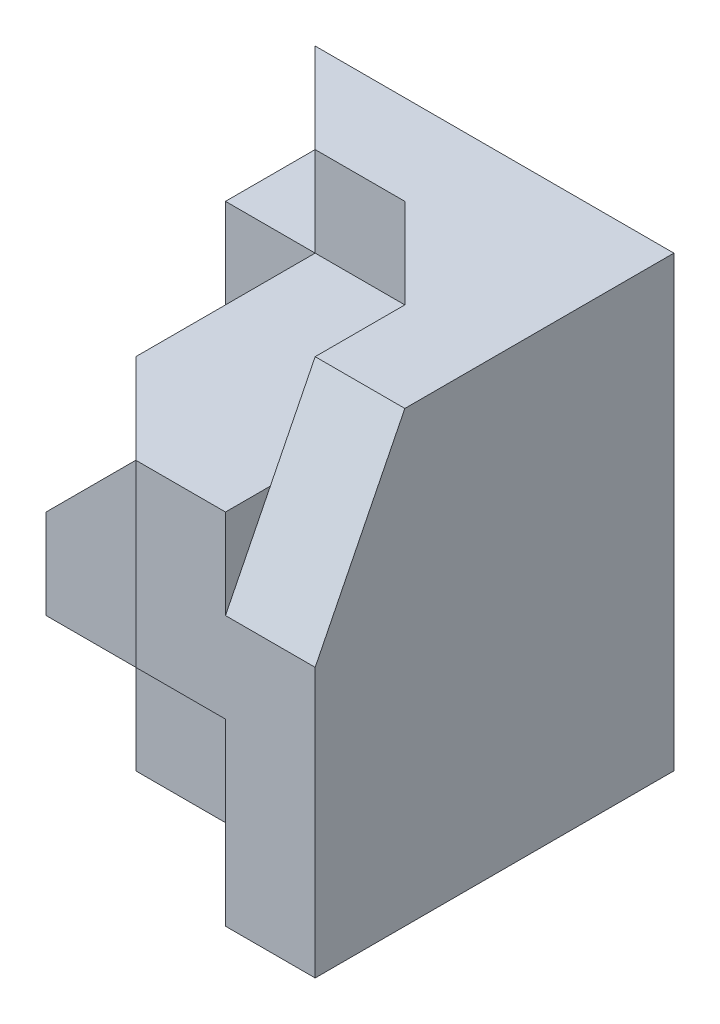
ISO-10303-21;
HEADER;
FILE_DESCRIPTION(('STEP AP214'),'2;1');
FILE_NAME('part.step','',(''),(''),'','','');
FILE_SCHEMA(('AUTOMOTIVE_DESIGN { 1 0 10303 214 1 1 1 1 }'));
ENDSEC;
DATA;
#1=APPLICATION_CONTEXT('core data for automotive mechanical design processes');
#2=APPLICATION_PROTOCOL_DEFINITION('international standard','automotive_design',2000,#1);
#3=PRODUCT_CONTEXT('',#1,'mechanical');
#4=PRODUCT('Part','Part','',(#3));
#5=PRODUCT_RELATED_PRODUCT_CATEGORY('part','',(#4));
#6=PRODUCT_DEFINITION_FORMATION('','',#4);
#7=PRODUCT_DEFINITION_CONTEXT('part definition',#1,'design');
#8=PRODUCT_DEFINITION('design','',#6,#7);
#9=PRODUCT_DEFINITION_SHAPE('','',#8);
#10=(LENGTH_UNIT() NAMED_UNIT(*) SI_UNIT(.MILLI.,.METRE.));
#11=(NAMED_UNIT(*) PLANE_ANGLE_UNIT() SI_UNIT($,.RADIAN.));
#12=(NAMED_UNIT(*) SI_UNIT($,.STERADIAN.) SOLID_ANGLE_UNIT());
#13=UNCERTAINTY_MEASURE_WITH_UNIT(LENGTH_MEASURE(1.E-05),#10,'distance_accuracy_value','');
#14=(GEOMETRIC_REPRESENTATION_CONTEXT(3) GLOBAL_UNCERTAINTY_ASSIGNED_CONTEXT((#13)) GLOBAL_UNIT_ASSIGNED_CONTEXT((#10,
#11,#12)) REPRESENTATION_CONTEXT('',''));
#15=CARTESIAN_POINT('',(0.,0.,0.));
#16=DIRECTION('',(0.,0.,1.));
#17=DIRECTION('',(1.,0.,0.));
#18=AXIS2_PLACEMENT_3D('',#15,#16,#17);
#19=CARTESIAN_POINT('',(-20.,50.,20.));
#20=DIRECTION('',(1.,0.,0.));
#21=DIRECTION('',(0.,0.,-1.));
#22=AXIS2_PLACEMENT_3D('',#19,#20,#21);
#23=PLANE('',#22);
#24=DIRECTION('',(0.,-1.,0.));
#25=VECTOR('',#24,1.);
#26=CARTESIAN_POINT('',(-20.,50.,-20.));
#27=LINE('',#26,#25);
#28=CARTESIAN_POINT('',(-20.,40.,-20.));
#29=VERTEX_POINT('',#28);
#30=CARTESIAN_POINT('',(-20.,10.,-20.));
#31=VERTEX_POINT('',#30);
#32=EDGE_CURVE('E192',#29,#31,#27,.T.);
#33=ORIENTED_EDGE('',*,*,#32,.T.);
#34=DIRECTION('',(0.,0.,1.));
#35=VECTOR('',#34,1.);
#36=CARTESIAN_POINT('',(-20.,10.,-20.));
#37=LINE('',#36,#35);
#38=CARTESIAN_POINT('',(-20.,10.,10.));
#39=VERTEX_POINT('',#38);
#40=EDGE_CURVE('E203',#31,#39,#37,.T.);
#41=ORIENTED_EDGE('',*,*,#40,.T.);
#42=DIRECTION('',(0.,-1.,0.));
#43=VECTOR('',#42,1.);
#44=CARTESIAN_POINT('',(-20.,0.,10.));
#45=LINE('',#44,#43);
#46=CARTESIAN_POINT('',(-20.,20.,10.));
#47=VERTEX_POINT('',#46);
#48=EDGE_CURVE('E223',#47,#39,#45,.T.);
#49=ORIENTED_EDGE('',*,*,#48,.F.);
#50=DIRECTION('',(0.,0.,1.));
#51=VECTOR('',#50,1.);
#52=CARTESIAN_POINT('',(-20.,20.,-9.99999999999999));
#53=LINE('',#52,#51);
#54=CARTESIAN_POINT('',(-20.,20.,-9.99999999999999));
#55=VERTEX_POINT('',#54);
#56=EDGE_CURVE('E243',#55,#47,#53,.T.);
#57=ORIENTED_EDGE('',*,*,#56,.F.);
#58=DIRECTION('',(0.,1.,0.));
#59=VECTOR('',#58,1.);
#60=CARTESIAN_POINT('',(-20.,30.,-10.));
#61=LINE('',#60,#59);
#62=CARTESIAN_POINT('',(-20.,40.,-10.));
#63=VERTEX_POINT('',#62);
#64=EDGE_CURVE('E256',#55,#63,#61,.T.);
#65=ORIENTED_EDGE('',*,*,#64,.T.);
#66=DIRECTION('',(0.,0.,1.));
#67=VECTOR('',#66,1.);
#68=CARTESIAN_POINT('',(-20.,40.,20.));
#69=LINE('',#68,#67);
#70=EDGE_CURVE('E207',#29,#63,#69,.T.);
#71=ORIENTED_EDGE('',*,*,#70,.F.);
#72=EDGE_LOOP('',(#33,#41,#49,#57,#65,#71));
#73=FACE_BOUND('',#72,.T.);
#74=ADVANCED_FACE('F33',(#73),#23,.F.);
#75=CARTESIAN_POINT('',(0.,40.,0.));
#76=DIRECTION('',(0.,-1.,0.));
#77=DIRECTION('',(0.,0.,-1.));
#78=AXIS2_PLACEMENT_3D('',#75,#76,#77);
#79=PLANE('',#78);
#80=ORIENTED_EDGE('',*,*,#70,.T.);
#81=DIRECTION('',(-1.,0.,0.));
#82=VECTOR('',#81,1.);
#83=CARTESIAN_POINT('',(-10.,40.,-10.));
#84=LINE('',#83,#82);
#85=CARTESIAN_POINT('',(-10.,40.,-10.));
#86=VERTEX_POINT('',#85);
#87=EDGE_CURVE('E250',#86,#63,#84,.T.);
#88=ORIENTED_EDGE('',*,*,#87,.F.);
#89=DIRECTION('',(-0.707106781186548,0.,-0.707106781186547));
#90=VECTOR('',#89,1.);
#91=CARTESIAN_POINT('',(-20.,40.,-20.));
#92=LINE('',#91,#90);
#93=EDGE_CURVE('E290',#86,#29,#92,.T.);
#94=ORIENTED_EDGE('',*,*,#93,.T.);
#95=EDGE_LOOP('',(#80,#88,#94));
#96=FACE_BOUND('',#95,.T.);
#97=ADVANCED_FACE('F341',(#96),#79,.F.);
#98=CARTESIAN_POINT('',(20.,50.,20.));
#99=DIRECTION('',(-1.,0.,0.));
#100=DIRECTION('',(0.,0.,1.));
#101=AXIS2_PLACEMENT_3D('',#98,#99,#100);
#102=PLANE('',#101);
#103=DIRECTION('',(0.,0.,-1.));
#104=VECTOR('',#103,1.);
#105=CARTESIAN_POINT('',(20.,50.,20.));
#106=LINE('',#105,#104);
#107=CARTESIAN_POINT('',(20.,50.,10.));
#108=VERTEX_POINT('',#107);
#109=CARTESIAN_POINT('',(20.,50.,-20.));
#110=VERTEX_POINT('',#109);
#111=EDGE_CURVE('E184',#108,#110,#106,.T.);
#112=ORIENTED_EDGE('',*,*,#111,.F.);
#113=DIRECTION('',(0.,0.894427190999916,-0.447213595499958));
#114=VECTOR('',#113,1.);
#115=CARTESIAN_POINT('',(20.,50.,10.));
#116=LINE('',#115,#114);
#117=CARTESIAN_POINT('',(20.,30.,20.));
#118=VERTEX_POINT('',#117);
#119=EDGE_CURVE('E258',#118,#108,#116,.T.);
#120=ORIENTED_EDGE('',*,*,#119,.F.);
#121=DIRECTION('',(0.,-1.,0.));
#122=VECTOR('',#121,1.);
#123=CARTESIAN_POINT('',(20.,50.,20.));
#124=LINE('',#123,#122);
#125=CARTESIAN_POINT('',(20.,0.,20.));
#126=VERTEX_POINT('',#125);
#127=EDGE_CURVE('E190',#118,#126,#124,.T.);
#128=ORIENTED_EDGE('',*,*,#127,.T.);
#129=DIRECTION('',(0.,0.,-1.));
#130=VECTOR('',#129,1.);
#131=CARTESIAN_POINT('',(20.,0.,20.));
#132=LINE('',#131,#130);
#133=CARTESIAN_POINT('',(20.,0.,-20.));
#134=VERTEX_POINT('',#133);
#135=EDGE_CURVE('E182',#126,#134,#132,.T.);
#136=ORIENTED_EDGE('',*,*,#135,.T.);
#137=DIRECTION('',(0.,-1.,0.));
#138=VECTOR('',#137,1.);
#139=CARTESIAN_POINT('',(20.,50.,-20.));
#140=LINE('',#139,#138);
#141=EDGE_CURVE('E11',#110,#134,#140,.T.);
#142=ORIENTED_EDGE('',*,*,#141,.F.);
#143=EDGE_LOOP('',(#112,#120,#128,#136,#142));
#144=FACE_BOUND('',#143,.T.);
#145=ADVANCED_FACE('F35',(#144),#102,.F.);
#146=CARTESIAN_POINT('',(-20.,50.,-20.));
#147=DIRECTION('',(0.,0.,1.));
#148=DIRECTION('',(1.,0.,0.));
#149=AXIS2_PLACEMENT_3D('',#146,#147,#148);
#150=PLANE('',#149);
#151=DIRECTION('',(0.,1.,0.));
#152=VECTOR('',#151,1.);
#153=CARTESIAN_POINT('',(-10.,0.,-20.));
#154=LINE('',#153,#152);
#155=CARTESIAN_POINT('',(-10.,0.,-20.));
#156=VERTEX_POINT('',#155);
#157=CARTESIAN_POINT('',(-10.,10.,-20.));
#158=VERTEX_POINT('',#157);
#159=EDGE_CURVE('E159',#156,#158,#154,.T.);
#160=ORIENTED_EDGE('',*,*,#159,.T.);
#161=DIRECTION('',(-1.,0.,0.));
#162=VECTOR('',#161,1.);
#163=CARTESIAN_POINT('',(-20.,10.,-20.));
#164=LINE('',#163,#162);
#165=EDGE_CURVE('E166',#158,#31,#164,.T.);
#166=ORIENTED_EDGE('',*,*,#165,.T.);
#167=ORIENTED_EDGE('',*,*,#32,.F.);
#168=CARTESIAN_POINT('',(-20.,50.,-20.));
#169=VERTEX_POINT('',#168);
#170=EDGE_CURVE('E41',#169,#29,#27,.T.);
#171=ORIENTED_EDGE('',*,*,#170,.F.);
#172=DIRECTION('',(-1.,0.,0.));
#173=VECTOR('',#172,1.);
#174=CARTESIAN_POINT('',(-20.,50.,-20.));
#175=LINE('',#174,#173);
#176=EDGE_CURVE('E193',#110,#169,#175,.T.);
#177=ORIENTED_EDGE('',*,*,#176,.F.);
#178=ORIENTED_EDGE('',*,*,#141,.T.);
#179=DIRECTION('',(-1.,0.,0.));
#180=VECTOR('',#179,1.);
#181=CARTESIAN_POINT('',(-20.,0.,-20.));
#182=LINE('',#181,#180);
#183=EDGE_CURVE('E173',#134,#156,#182,.T.);
#184=ORIENTED_EDGE('',*,*,#183,.T.);
#185=EDGE_LOOP('',(#160,#166,#167,#171,#177,#178,#184));
#186=FACE_BOUND('',#185,.T.);
#187=ADVANCED_FACE('F177',(#186),#150,.F.);
#188=CARTESIAN_POINT('',(-20.,50.,20.));
#189=DIRECTION('',(0.,0.,-1.));
#190=DIRECTION('',(-1.,0.,0.));
#191=AXIS2_PLACEMENT_3D('',#188,#189,#190);
#192=PLANE('',#191);
#193=DIRECTION('',(-1.,0.,0.));
#194=VECTOR('',#193,1.);
#195=CARTESIAN_POINT('',(9.99999999999999,20.,20.));
#196=LINE('',#195,#194);
#197=CARTESIAN_POINT('',(9.99999999999999,20.,20.));
#198=VERTEX_POINT('',#197);
#199=CARTESIAN_POINT('',(0.,20.,20.));
#200=VERTEX_POINT('',#199);
#201=EDGE_CURVE('E221',#198,#200,#196,.T.);
#202=ORIENTED_EDGE('',*,*,#201,.F.);
#203=DIRECTION('',(0.,1.,0.));
#204=VECTOR('',#203,1.);
#205=CARTESIAN_POINT('',(9.99999999999999,0.,20.));
#206=LINE('',#205,#204);
#207=CARTESIAN_POINT('',(9.99999999999999,0.,20.));
#208=VERTEX_POINT('',#207);
#209=EDGE_CURVE('E215',#208,#198,#206,.T.);
#210=ORIENTED_EDGE('',*,*,#209,.F.);
#211=DIRECTION('',(1.,0.,0.));
#212=VECTOR('',#211,1.);
#213=CARTESIAN_POINT('',(-20.,0.,20.));
#214=LINE('',#213,#212);
#215=EDGE_CURVE('E181',#208,#126,#214,.T.);
#216=ORIENTED_EDGE('',*,*,#215,.T.);
#217=ORIENTED_EDGE('',*,*,#127,.F.);
#218=DIRECTION('',(1.,0.,0.));
#219=VECTOR('',#218,1.);
#220=CARTESIAN_POINT('',(10.,30.,20.));
#221=LINE('',#220,#219);
#222=CARTESIAN_POINT('',(10.,30.,20.));
#223=VERTEX_POINT('',#222);
#224=EDGE_CURVE('E269',#223,#118,#221,.T.);
#225=ORIENTED_EDGE('',*,*,#224,.F.);
#226=DIRECTION('',(0.,-1.,0.));
#227=VECTOR('',#226,1.);
#228=CARTESIAN_POINT('',(10.,30.,20.));
#229=LINE('',#228,#227);
#230=CARTESIAN_POINT('',(10.,40.,20.));
#231=VERTEX_POINT('',#230);
#232=EDGE_CURVE('E264',#231,#223,#229,.T.);
#233=ORIENTED_EDGE('',*,*,#232,.F.);
#234=DIRECTION('',(1.,0.,0.));
#235=VECTOR('',#234,1.);
#236=CARTESIAN_POINT('',(10.,40.,20.));
#237=LINE('',#236,#235);
#238=CARTESIAN_POINT('',(0.,40.,20.));
#239=VERTEX_POINT('',#238);
#240=EDGE_CURVE('E277',#239,#231,#237,.T.);
#241=ORIENTED_EDGE('',*,*,#240,.F.);
#242=DIRECTION('',(0.,1.,0.));
#243=VECTOR('',#242,1.);
#244=CARTESIAN_POINT('',(0.,30.,20.));
#245=LINE('',#244,#243);
#246=EDGE_CURVE('E56',#200,#239,#245,.T.);
#247=ORIENTED_EDGE('',*,*,#246,.F.);
#248=EDGE_LOOP('',(#202,#210,#216,#217,#225,#233,#241,#247));
#249=FACE_BOUND('',#248,.T.);
#250=ADVANCED_FACE('F320',(#249),#192,.F.);
#251=CARTESIAN_POINT('',(0.,50.,0.));
#252=DIRECTION('',(0.,-1.,0.));
#253=DIRECTION('',(0.,0.,-1.));
#254=AXIS2_PLACEMENT_3D('',#251,#252,#253);
#255=PLANE('',#254);
#256=DIRECTION('',(0.,0.,-1.));
#257=VECTOR('',#256,1.);
#258=CARTESIAN_POINT('',(10.,50.,0.));
#259=LINE('',#258,#257);
#260=CARTESIAN_POINT('',(10.,50.,10.));
#261=VERTEX_POINT('',#260);
#262=CARTESIAN_POINT('',(10.,50.,0.));
#263=VERTEX_POINT('',#262);
#264=EDGE_CURVE('E274',#261,#263,#259,.T.);
#265=ORIENTED_EDGE('',*,*,#264,.F.);
#266=DIRECTION('',(1.,0.,0.));
#267=VECTOR('',#266,1.);
#268=CARTESIAN_POINT('',(10.,50.,10.));
#269=LINE('',#268,#267);
#270=EDGE_CURVE('E271',#261,#108,#269,.T.);
#271=ORIENTED_EDGE('',*,*,#270,.T.);
#272=ORIENTED_EDGE('',*,*,#111,.T.);
#273=ORIENTED_EDGE('',*,*,#176,.T.);
#274=DIRECTION('',(-0.707106781186548,0.,-0.707106781186547));
#275=VECTOR('',#274,1.);
#276=CARTESIAN_POINT('',(-20.,50.,-20.));
#277=LINE('',#276,#275);
#278=CARTESIAN_POINT('',(-10.,50.,-10.));
#279=VERTEX_POINT('',#278);
#280=EDGE_CURVE('E278',#279,#169,#277,.T.);
#281=ORIENTED_EDGE('',*,*,#280,.F.);
#282=DIRECTION('',(-1.,0.,0.));
#283=VECTOR('',#282,1.);
#284=CARTESIAN_POINT('',(-10.,50.,-10.));
#285=LINE('',#284,#283);
#286=CARTESIAN_POINT('',(0.,50.,-10.));
#287=VERTEX_POINT('',#286);
#288=EDGE_CURVE('E297',#287,#279,#285,.T.);
#289=ORIENTED_EDGE('',*,*,#288,.F.);
#290=DIRECTION('',(-0.707106781186548,0.,-0.707106781186548));
#291=VECTOR('',#290,1.);
#292=CARTESIAN_POINT('',(0.,50.,-10.));
#293=LINE('',#292,#291);
#294=EDGE_CURVE('E294',#263,#287,#293,.T.);
#295=ORIENTED_EDGE('',*,*,#294,.F.);
#296=EDGE_LOOP('',(#265,#271,#272,#273,#281,#289,#295));
#297=FACE_BOUND('',#296,.T.);
#298=ADVANCED_FACE('F310',(#297),#255,.F.);
#299=CARTESIAN_POINT('',(0.,0.,0.));
#300=DIRECTION('',(0.,-1.,0.));
#301=DIRECTION('',(0.,0.,-1.));
#302=AXIS2_PLACEMENT_3D('',#299,#300,#301);
#303=PLANE('',#302);
#304=DIRECTION('',(0.,0.,1.));
#305=VECTOR('',#304,1.);
#306=CARTESIAN_POINT('',(-10.,0.,-20.));
#307=LINE('',#306,#305);
#308=CARTESIAN_POINT('',(-10.,0.,10.));
#309=VERTEX_POINT('',#308);
#310=EDGE_CURVE('E48',#156,#309,#307,.T.);
#311=ORIENTED_EDGE('',*,*,#310,.F.);
#312=ORIENTED_EDGE('',*,*,#183,.F.);
#313=ORIENTED_EDGE('',*,*,#135,.F.);
#314=ORIENTED_EDGE('',*,*,#215,.F.);
#315=DIRECTION('',(0.,0.,1.));
#316=VECTOR('',#315,1.);
#317=CARTESIAN_POINT('',(9.99999999999999,0.,10.));
#318=LINE('',#317,#316);
#319=CARTESIAN_POINT('',(9.99999999999999,0.,10.));
#320=VERTEX_POINT('',#319);
#321=EDGE_CURVE('E230',#320,#208,#318,.T.);
#322=ORIENTED_EDGE('',*,*,#321,.F.);
#323=DIRECTION('',(1.,0.,0.));
#324=VECTOR('',#323,1.);
#325=CARTESIAN_POINT('',(9.99999999999999,0.,10.));
#326=LINE('',#325,#324);
#327=EDGE_CURVE('E175',#309,#320,#326,.T.);
#328=ORIENTED_EDGE('',*,*,#327,.F.);
#329=EDGE_LOOP('',(#311,#312,#313,#314,#322,#328));
#330=FACE_BOUND('',#329,.T.);
#331=ADVANCED_FACE('F171',(#330),#303,.T.);
#332=CARTESIAN_POINT('',(-20.,40.,-20.));
#333=DIRECTION('',(0.707106781186547,0.,-0.707106781186548));
#334=DIRECTION('',(-0.707106781186548,0.,-0.707106781186547));
#335=AXIS2_PLACEMENT_3D('',#332,#333,#334);
#336=PLANE('',#335);
#337=ORIENTED_EDGE('',*,*,#280,.T.);
#338=ORIENTED_EDGE('',*,*,#170,.T.);
#339=ORIENTED_EDGE('',*,*,#93,.F.);
#340=DIRECTION('',(0.,1.,0.));
#341=VECTOR('',#340,1.);
#342=CARTESIAN_POINT('',(-10.,40.,-10.));
#343=LINE('',#342,#341);
#344=EDGE_CURVE('E186',#86,#279,#343,.T.);
#345=ORIENTED_EDGE('',*,*,#344,.T.);
#346=EDGE_LOOP('',(#337,#338,#339,#345));
#347=FACE_BOUND('',#346,.T.);
#348=ADVANCED_FACE('F376',(#347),#336,.F.);
#349=CARTESIAN_POINT('',(-10.,40.,-10.));
#350=DIRECTION('',(0.,0.,-1.));
#351=DIRECTION('',(-1.,0.,0.));
#352=AXIS2_PLACEMENT_3D('',#349,#350,#351);
#353=PLANE('',#352);
#354=ORIENTED_EDGE('',*,*,#288,.T.);
#355=ORIENTED_EDGE('',*,*,#344,.F.);
#356=DIRECTION('',(-1.,0.,0.));
#357=VECTOR('',#356,1.);
#358=CARTESIAN_POINT('',(-10.,40.,-10.));
#359=LINE('',#358,#357);
#360=CARTESIAN_POINT('',(0.,40.,-10.));
#361=VERTEX_POINT('',#360);
#362=EDGE_CURVE('E287',#361,#86,#359,.T.);
#363=ORIENTED_EDGE('',*,*,#362,.F.);
#364=DIRECTION('',(0.,1.,0.));
#365=VECTOR('',#364,1.);
#366=CARTESIAN_POINT('',(0.,40.,-10.));
#367=LINE('',#366,#365);
#368=EDGE_CURVE('E302',#361,#287,#367,.T.);
#369=ORIENTED_EDGE('',*,*,#368,.T.);
#370=EDGE_LOOP('',(#354,#355,#363,#369));
#371=FACE_BOUND('',#370,.T.);
#372=ADVANCED_FACE('F381',(#371),#353,.F.);
#373=CARTESIAN_POINT('',(0.,40.,-10.));
#374=DIRECTION('',(0.707106781186548,0.,-0.707106781186548));
#375=DIRECTION('',(-0.707106781186548,0.,-0.707106781186548));
#376=AXIS2_PLACEMENT_3D('',#373,#374,#375);
#377=PLANE('',#376);
#378=ORIENTED_EDGE('',*,*,#294,.T.);
#379=ORIENTED_EDGE('',*,*,#368,.F.);
#380=DIRECTION('',(-0.707106781186548,0.,-0.707106781186548));
#381=VECTOR('',#380,1.);
#382=CARTESIAN_POINT('',(0.,40.,-10.));
#383=LINE('',#382,#381);
#384=CARTESIAN_POINT('',(10.,40.,0.));
#385=VERTEX_POINT('',#384);
#386=EDGE_CURVE('E284',#385,#361,#383,.T.);
#387=ORIENTED_EDGE('',*,*,#386,.F.);
#388=DIRECTION('',(0.,1.,0.));
#389=VECTOR('',#388,1.);
#390=CARTESIAN_POINT('',(10.,40.,0.));
#391=LINE('',#390,#389);
#392=EDGE_CURVE('E292',#385,#263,#391,.T.);
#393=ORIENTED_EDGE('',*,*,#392,.T.);
#394=EDGE_LOOP('',(#378,#379,#387,#393));
#395=FACE_BOUND('',#394,.T.);
#396=ADVANCED_FACE('F392',(#395),#377,.F.);
#397=CARTESIAN_POINT('',(10.,40.,0.));
#398=DIRECTION('',(1.,0.,0.));
#399=DIRECTION('',(0.,0.,-1.));
#400=AXIS2_PLACEMENT_3D('',#397,#398,#399);
#401=PLANE('',#400);
#402=DIRECTION('',(0.,0.,-1.));
#403=VECTOR('',#402,1.);
#404=CARTESIAN_POINT('',(10.,40.,0.));
#405=LINE('',#404,#403);
#406=CARTESIAN_POINT('',(10.,40.,15.));
#407=VERTEX_POINT('',#406);
#408=EDGE_CURVE('E280',#407,#385,#405,.T.);
#409=ORIENTED_EDGE('',*,*,#408,.F.);
#410=DIRECTION('',(0.,0.894427190999916,-0.447213595499958));
#411=VECTOR('',#410,1.);
#412=CARTESIAN_POINT('',(10.,50.,10.));
#413=LINE('',#412,#411);
#414=EDGE_CURVE('E266',#407,#261,#413,.T.);
#415=ORIENTED_EDGE('',*,*,#414,.T.);
#416=ORIENTED_EDGE('',*,*,#264,.T.);
#417=ORIENTED_EDGE('',*,*,#392,.F.);
#418=EDGE_LOOP('',(#409,#415,#416,#417));
#419=FACE_BOUND('',#418,.T.);
#420=ADVANCED_FACE('F405',(#419),#401,.F.);
#421=ORIENTED_EDGE('',*,*,#362,.T.);
#422=DIRECTION('',(0.,0.,-1.));
#423=VECTOR('',#422,1.);
#424=CARTESIAN_POINT('',(-10.,40.,-10.));
#425=LINE('',#424,#423);
#426=CARTESIAN_POINT('',(-10.,40.,10.));
#427=VERTEX_POINT('',#426);
#428=EDGE_CURVE('E252',#427,#86,#425,.T.);
#429=ORIENTED_EDGE('',*,*,#428,.F.);
#430=DIRECTION('',(-0.707106781186548,0.,-0.707106781186547));
#431=VECTOR('',#430,1.);
#432=CARTESIAN_POINT('',(0.,40.,20.));
#433=LINE('',#432,#431);
#434=EDGE_CURVE('E246',#239,#427,#433,.T.);
#435=ORIENTED_EDGE('',*,*,#434,.F.);
#436=ORIENTED_EDGE('',*,*,#240,.T.);
#437=EDGE_CURVE('E281',#231,#407,#405,.T.);
#438=ORIENTED_EDGE('',*,*,#437,.T.);
#439=ORIENTED_EDGE('',*,*,#408,.T.);
#440=ORIENTED_EDGE('',*,*,#386,.T.);
#441=EDGE_LOOP('',(#421,#429,#435,#436,#438,#439,#440));
#442=FACE_BOUND('',#441,.T.);
#443=ADVANCED_FACE('F348',(#442),#79,.F.);
#444=CARTESIAN_POINT('',(10.,0.,0.));
#445=DIRECTION('',(-1.,0.,0.));
#446=DIRECTION('',(0.,0.,1.));
#447=AXIS2_PLACEMENT_3D('',#444,#445,#446);
#448=PLANE('',#447);
#449=ORIENTED_EDGE('',*,*,#232,.T.);
#450=EDGE_CURVE('E267',#223,#407,#413,.T.);
#451=ORIENTED_EDGE('',*,*,#450,.T.);
#452=ORIENTED_EDGE('',*,*,#437,.F.);
#453=EDGE_LOOP('',(#449,#451,#452));
#454=FACE_BOUND('',#453,.T.);
#455=ADVANCED_FACE('F404',(#454),#448,.F.);
#456=CARTESIAN_POINT('',(10.,50.,10.));
#457=DIRECTION('',(0.,-0.447213595499958,-0.894427190999916));
#458=DIRECTION('',(0.,0.894427190999916,-0.447213595499958));
#459=AXIS2_PLACEMENT_3D('',#456,#457,#458);
#460=PLANE('',#459);
#461=ORIENTED_EDGE('',*,*,#119,.T.);
#462=ORIENTED_EDGE('',*,*,#270,.F.);
#463=ORIENTED_EDGE('',*,*,#414,.F.);
#464=ORIENTED_EDGE('',*,*,#450,.F.);
#465=ORIENTED_EDGE('',*,*,#224,.T.);
#466=EDGE_LOOP('',(#461,#462,#463,#464,#465));
#467=FACE_BOUND('',#466,.T.);
#468=ADVANCED_FACE('F372',(#467),#460,.F.);
#469=CARTESIAN_POINT('',(-10.,30.,-10.));
#470=DIRECTION('',(0.,0.,-1.));
#471=DIRECTION('',(-1.,0.,0.));
#472=AXIS2_PLACEMENT_3D('',#469,#470,#471);
#473=PLANE('',#472);
#474=ORIENTED_EDGE('',*,*,#87,.T.);
#475=ORIENTED_EDGE('',*,*,#64,.F.);
#476=DIRECTION('',(0.707106781186547,0.707106781186548,0.));
#477=VECTOR('',#476,1.);
#478=CARTESIAN_POINT('',(-10.,30.,-9.99999999999999));
#479=LINE('',#478,#477);
#480=CARTESIAN_POINT('',(-10.,30.,-10.));
#481=VERTEX_POINT('',#480);
#482=EDGE_CURVE('E241',#55,#481,#479,.T.);
#483=ORIENTED_EDGE('',*,*,#482,.T.);
#484=DIRECTION('',(0.,1.,0.));
#485=VECTOR('',#484,1.);
#486=CARTESIAN_POINT('',(-10.,30.,-10.));
#487=LINE('',#486,#485);
#488=EDGE_CURVE('E259',#481,#86,#487,.T.);
#489=ORIENTED_EDGE('',*,*,#488,.T.);
#490=EDGE_LOOP('',(#474,#475,#483,#489));
#491=FACE_BOUND('',#490,.T.);
#492=ADVANCED_FACE('F414',(#491),#473,.F.);
#493=CARTESIAN_POINT('',(-10.,30.,-10.));
#494=DIRECTION('',(1.,0.,0.));
#495=DIRECTION('',(0.,0.,-1.));
#496=AXIS2_PLACEMENT_3D('',#493,#494,#495);
#497=PLANE('',#496);
#498=ORIENTED_EDGE('',*,*,#428,.T.);
#499=ORIENTED_EDGE('',*,*,#488,.F.);
#500=DIRECTION('',(0.,0.,-1.));
#501=VECTOR('',#500,1.);
#502=CARTESIAN_POINT('',(-10.,30.,-10.));
#503=LINE('',#502,#501);
#504=CARTESIAN_POINT('',(-10.,30.,10.));
#505=VERTEX_POINT('',#504);
#506=EDGE_CURVE('E247',#505,#481,#503,.T.);
#507=ORIENTED_EDGE('',*,*,#506,.F.);
#508=DIRECTION('',(0.,1.,0.));
#509=VECTOR('',#508,1.);
#510=CARTESIAN_POINT('',(-10.,30.,10.));
#511=LINE('',#510,#509);
#512=EDGE_CURVE('E261',#505,#427,#511,.T.);
#513=ORIENTED_EDGE('',*,*,#512,.T.);
#514=EDGE_LOOP('',(#498,#499,#507,#513));
#515=FACE_BOUND('',#514,.T.);
#516=ADVANCED_FACE('F419',(#515),#497,.F.);
#517=CARTESIAN_POINT('',(0.,30.,20.));
#518=DIRECTION('',(0.707106781186547,0.,-0.707106781186548));
#519=DIRECTION('',(-0.707106781186548,0.,-0.707106781186547));
#520=AXIS2_PLACEMENT_3D('',#517,#518,#519);
#521=PLANE('',#520);
#522=ORIENTED_EDGE('',*,*,#434,.T.);
#523=ORIENTED_EDGE('',*,*,#512,.F.);
#524=DIRECTION('',(0.,1.,0.));
#525=VECTOR('',#524,1.);
#526=CARTESIAN_POINT('',(-10.,20.,10.));
#527=LINE('',#526,#525);
#528=CARTESIAN_POINT('',(-10.,20.,10.));
#529=VERTEX_POINT('',#528);
#530=EDGE_CURVE('E239',#529,#505,#527,.T.);
#531=ORIENTED_EDGE('',*,*,#530,.F.);
#532=DIRECTION('',(-0.707106781186548,0.,-0.707106781186548));
#533=VECTOR('',#532,1.);
#534=CARTESIAN_POINT('',(0.,20.,20.));
#535=LINE('',#534,#533);
#536=EDGE_CURVE('E236',#200,#529,#535,.T.);
#537=ORIENTED_EDGE('',*,*,#536,.F.);
#538=ORIENTED_EDGE('',*,*,#246,.T.);
#539=EDGE_LOOP('',(#522,#523,#531,#537,#538));
#540=FACE_BOUND('',#539,.T.);
#541=ADVANCED_FACE('F431',(#540),#521,.F.);
#542=CARTESIAN_POINT('',(-10.,30.,-9.99999999999999));
#543=DIRECTION('',(0.707106781186548,-0.707106781186547,0.));
#544=DIRECTION('',(0.707106781186547,0.707106781186548,0.));
#545=AXIS2_PLACEMENT_3D('',#542,#543,#544);
#546=PLANE('',#545);
#547=ORIENTED_EDGE('',*,*,#56,.T.);
#548=DIRECTION('',(0.707106781186547,0.707106781186548,0.));
#549=VECTOR('',#548,1.);
#550=CARTESIAN_POINT('',(-10.,30.,10.));
#551=LINE('',#550,#549);
#552=EDGE_CURVE('E232',#47,#505,#551,.T.);
#553=ORIENTED_EDGE('',*,*,#552,.T.);
#554=ORIENTED_EDGE('',*,*,#506,.T.);
#555=ORIENTED_EDGE('',*,*,#482,.F.);
#556=EDGE_LOOP('',(#547,#553,#554,#555));
#557=FACE_BOUND('',#556,.T.);
#558=ADVANCED_FACE('F450',(#557),#546,.F.);
#559=CARTESIAN_POINT('',(-20.,20.,10.));
#560=DIRECTION('',(0.,0.,-1.));
#561=DIRECTION('',(-1.,0.,0.));
#562=AXIS2_PLACEMENT_3D('',#559,#560,#561);
#563=PLANE('',#562);
#564=ORIENTED_EDGE('',*,*,#48,.T.);
#565=DIRECTION('',(-1.,0.,0.));
#566=VECTOR('',#565,1.);
#567=CARTESIAN_POINT('',(-20.,10.,10.));
#568=LINE('',#567,#566);
#569=CARTESIAN_POINT('',(-10.,10.,10.));
#570=VERTEX_POINT('',#569);
#571=EDGE_CURVE('E167',#570,#39,#568,.T.);
#572=ORIENTED_EDGE('',*,*,#571,.F.);
#573=DIRECTION('',(0.,1.,0.));
#574=VECTOR('',#573,1.);
#575=CARTESIAN_POINT('',(-10.,0.,10.));
#576=LINE('',#575,#574);
#577=EDGE_CURVE('E211',#309,#570,#576,.T.);
#578=ORIENTED_EDGE('',*,*,#577,.F.);
#579=ORIENTED_EDGE('',*,*,#327,.T.);
#580=DIRECTION('',(0.,1.,0.));
#581=VECTOR('',#580,1.);
#582=CARTESIAN_POINT('',(9.99999999999999,0.,10.));
#583=LINE('',#582,#581);
#584=CARTESIAN_POINT('',(9.99999999999999,20.,10.));
#585=VERTEX_POINT('',#584);
#586=EDGE_CURVE('E217',#320,#585,#583,.T.);
#587=ORIENTED_EDGE('',*,*,#586,.T.);
#588=DIRECTION('',(-1.,0.,0.));
#589=VECTOR('',#588,1.);
#590=CARTESIAN_POINT('',(9.99999999999999,20.,10.));
#591=LINE('',#590,#589);
#592=EDGE_CURVE('E220',#585,#529,#591,.T.);
#593=ORIENTED_EDGE('',*,*,#592,.T.);
#594=ORIENTED_EDGE('',*,*,#530,.T.);
#595=ORIENTED_EDGE('',*,*,#552,.F.);
#596=EDGE_LOOP('',(#564,#572,#578,#579,#587,#593,#594,#595));
#597=FACE_BOUND('',#596,.T.);
#598=ADVANCED_FACE('F327',(#597),#563,.F.);
#599=CARTESIAN_POINT('',(9.99999999999999,20.,10.));
#600=DIRECTION('',(0.,1.,0.));
#601=DIRECTION('',(0.,0.,1.));
#602=AXIS2_PLACEMENT_3D('',#599,#600,#601);
#603=PLANE('',#602);
#604=ORIENTED_EDGE('',*,*,#592,.F.);
#605=DIRECTION('',(0.,0.,1.));
#606=VECTOR('',#605,1.);
#607=CARTESIAN_POINT('',(9.99999999999999,20.,10.));
#608=LINE('',#607,#606);
#609=EDGE_CURVE('E226',#585,#198,#608,.T.);
#610=ORIENTED_EDGE('',*,*,#609,.T.);
#611=ORIENTED_EDGE('',*,*,#201,.T.);
#612=ORIENTED_EDGE('',*,*,#536,.T.);
#613=EDGE_LOOP('',(#604,#610,#611,#612));
#614=FACE_BOUND('',#613,.T.);
#615=ADVANCED_FACE('F338',(#614),#603,.F.);
#616=CARTESIAN_POINT('',(9.99999999999999,0.,10.));
#617=DIRECTION('',(1.,0.,0.));
#618=DIRECTION('',(0.,0.,-1.));
#619=AXIS2_PLACEMENT_3D('',#616,#617,#618);
#620=PLANE('',#619);
#621=ORIENTED_EDGE('',*,*,#209,.T.);
#622=ORIENTED_EDGE('',*,*,#609,.F.);
#623=ORIENTED_EDGE('',*,*,#586,.F.);
#624=ORIENTED_EDGE('',*,*,#321,.T.);
#625=EDGE_LOOP('',(#621,#622,#623,#624));
#626=FACE_BOUND('',#625,.T.);
#627=ADVANCED_FACE('F323',(#626),#620,.F.);
#628=CARTESIAN_POINT('',(-20.,10.,-20.));
#629=DIRECTION('',(0.,1.,0.));
#630=DIRECTION('',(0.,0.,1.));
#631=AXIS2_PLACEMENT_3D('',#628,#629,#630);
#632=PLANE('',#631);
#633=ORIENTED_EDGE('',*,*,#571,.T.);
#634=ORIENTED_EDGE('',*,*,#40,.F.);
#635=ORIENTED_EDGE('',*,*,#165,.F.);
#636=DIRECTION('',(0.,0.,1.));
#637=VECTOR('',#636,1.);
#638=CARTESIAN_POINT('',(-10.,10.,-20.));
#639=LINE('',#638,#637);
#640=EDGE_CURVE('E161',#158,#570,#639,.T.);
#641=ORIENTED_EDGE('',*,*,#640,.T.);
#642=EDGE_LOOP('',(#633,#634,#635,#641));
#643=FACE_BOUND('',#642,.T.);
#644=ADVANCED_FACE('F330',(#643),#632,.F.);
#645=CARTESIAN_POINT('',(-10.,0.,-20.));
#646=DIRECTION('',(1.,0.,0.));
#647=DIRECTION('',(0.,0.,-1.));
#648=AXIS2_PLACEMENT_3D('',#645,#646,#647);
#649=PLANE('',#648);
#650=ORIENTED_EDGE('',*,*,#577,.T.);
#651=ORIENTED_EDGE('',*,*,#640,.F.);
#652=ORIENTED_EDGE('',*,*,#159,.F.);
#653=ORIENTED_EDGE('',*,*,#310,.T.);
#654=EDGE_LOOP('',(#650,#651,#652,#653));
#655=FACE_BOUND('',#654,.T.);
#656=ADVANCED_FACE('F160',(#655),#649,.F.);
#657=CLOSED_SHELL('',(#74,#97,#145,#187,#250,#298,#331,#348,#372,#396,#420,#443,#455,#468,#492,
#516,#541,#558,#598,#615,#627,#644,#656));
#658=MANIFOLD_SOLID_BREP('B2',#657);
#659=ADVANCED_BREP_SHAPE_REPRESENTATION('',(#18,#658),#14);
#660=SHAPE_DEFINITION_REPRESENTATION(#9,#659);
ENDSEC;
END-ISO-10303-21;
